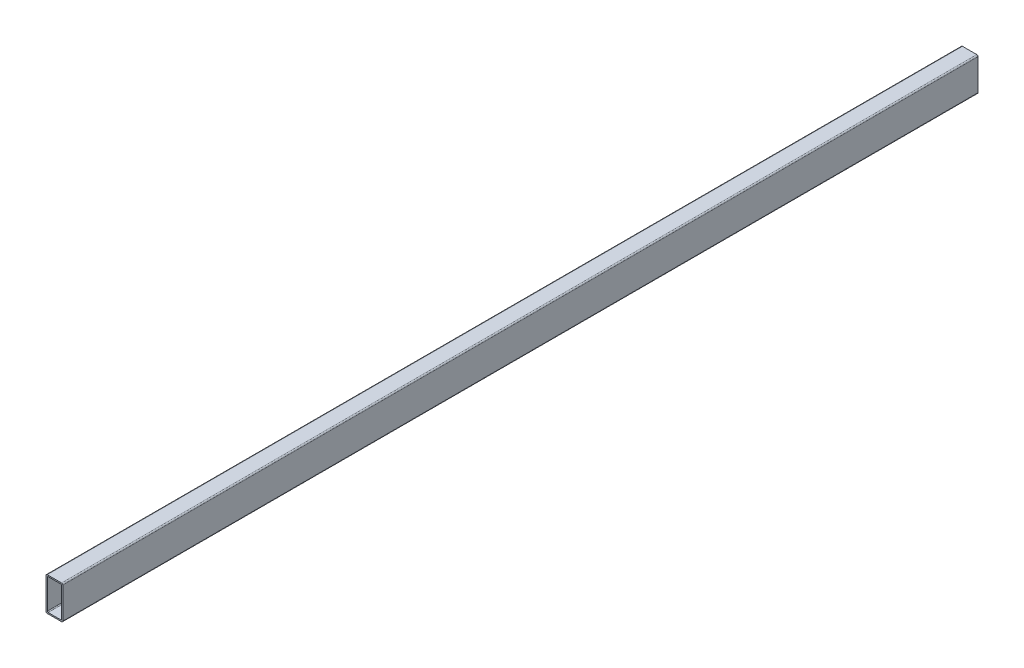
ISO-10303-21;
HEADER;
FILE_DESCRIPTION(('STEP AP214'),'2;1');
FILE_NAME('part.step','',(''),(''),'','','');
FILE_SCHEMA(('AUTOMOTIVE_DESIGN { 1 0 10303 214 1 1 1 1 }'));
ENDSEC;
DATA;
#1=APPLICATION_CONTEXT('core data for automotive mechanical design processes');
#2=APPLICATION_PROTOCOL_DEFINITION('international standard','automotive_design',2000,#1);
#3=PRODUCT_CONTEXT('',#1,'mechanical');
#4=PRODUCT('Part','Part','',(#3));
#5=PRODUCT_RELATED_PRODUCT_CATEGORY('part','',(#4));
#6=PRODUCT_DEFINITION_FORMATION('','',#4);
#7=PRODUCT_DEFINITION_CONTEXT('part definition',#1,'design');
#8=PRODUCT_DEFINITION('design','',#6,#7);
#9=PRODUCT_DEFINITION_SHAPE('','',#8);
#10=(LENGTH_UNIT() NAMED_UNIT(*) SI_UNIT(.MILLI.,.METRE.));
#11=(NAMED_UNIT(*) PLANE_ANGLE_UNIT() SI_UNIT($,.RADIAN.));
#12=(NAMED_UNIT(*) SI_UNIT($,.STERADIAN.) SOLID_ANGLE_UNIT());
#13=UNCERTAINTY_MEASURE_WITH_UNIT(LENGTH_MEASURE(1.E-05),#10,'distance_accuracy_value','');
#14=(GEOMETRIC_REPRESENTATION_CONTEXT(3) GLOBAL_UNCERTAINTY_ASSIGNED_CONTEXT((#13)) GLOBAL_UNIT_ASSIGNED_CONTEXT((#10,
#11,#12)) REPRESENTATION_CONTEXT('',''));
#15=CARTESIAN_POINT('',(0.,0.,0.));
#16=DIRECTION('',(0.,0.,1.));
#17=DIRECTION('',(1.,0.,0.));
#18=AXIS2_PLACEMENT_3D('',#15,#16,#17);
#19=CARTESIAN_POINT('',(-1.5,38.5,-150.));
#20=DIRECTION('',(0.,0.,1.));
#21=DIRECTION('',(1.,0.,0.));
#22=AXIS2_PLACEMENT_3D('',#19,#20,#21);
#23=CYLINDRICAL_SURFACE('',#22,1.5);
#24=DIRECTION('',(0.,0.,1.));
#25=VECTOR('',#24,1.);
#26=CARTESIAN_POINT('',(-1.50000000000002,40.,-150.));
#27=LINE('',#26,#25);
#28=CARTESIAN_POINT('',(-1.50000000000002,40.,-150.));
#29=VERTEX_POINT('',#28);
#30=CARTESIAN_POINT('',(-1.50000000000002,40.,939.980118087264));
#31=VERTEX_POINT('',#30);
#32=EDGE_CURVE('E38',#29,#31,#27,.T.);
#33=ORIENTED_EDGE('',*,*,#32,.T.);
#34=CARTESIAN_POINT('',(-1.5,38.5,939.980118087264));
#35=DIRECTION('',(0.,0.,-1.));
#36=DIRECTION('',(0.,1.,0.));
#37=AXIS2_PLACEMENT_3D('',#34,#35,#36);
#38=CIRCLE('',#37,1.5);
#39=CARTESIAN_POINT('',(0.,38.5,939.980118087264));
#40=VERTEX_POINT('',#39);
#41=EDGE_CURVE('E167',#31,#40,#38,.T.);
#42=ORIENTED_EDGE('',*,*,#41,.T.);
#43=DIRECTION('',(0.,0.,1.));
#44=VECTOR('',#43,1.);
#45=CARTESIAN_POINT('',(0.,38.5,-150.));
#46=LINE('',#45,#44);
#47=CARTESIAN_POINT('',(0.,38.5,-150.));
#48=VERTEX_POINT('',#47);
#49=EDGE_CURVE('E11',#48,#40,#46,.T.);
#50=ORIENTED_EDGE('',*,*,#49,.F.);
#51=CARTESIAN_POINT('',(-1.5,38.5,-150.));
#52=DIRECTION('',(0.,0.,1.));
#53=DIRECTION('',(-1.,0.,0.));
#54=AXIS2_PLACEMENT_3D('',#51,#52,#53);
#55=CIRCLE('',#54,1.5);
#56=EDGE_CURVE('E234',#48,#29,#55,.T.);
#57=ORIENTED_EDGE('',*,*,#56,.T.);
#58=EDGE_LOOP('',(#33,#42,#50,#57));
#59=FACE_BOUND('',#58,.T.);
#60=ADVANCED_FACE('F35',(#59),#23,.T.);
#61=CARTESIAN_POINT('',(0.,38.5,-150.));
#62=DIRECTION('',(1.,0.,0.));
#63=DIRECTION('',(0.,1.,0.));
#64=AXIS2_PLACEMENT_3D('',#61,#62,#63);
#65=PLANE('',#64);
#66=ORIENTED_EDGE('',*,*,#49,.T.);
#67=DIRECTION('',(0.,-1.,0.));
#68=VECTOR('',#67,1.);
#69=CARTESIAN_POINT('',(0.,38.5,939.980118087264));
#70=LINE('',#69,#68);
#71=CARTESIAN_POINT('',(0.,1.50000000000003,939.980118087264));
#72=VERTEX_POINT('',#71);
#73=EDGE_CURVE('E184',#40,#72,#70,.T.);
#74=ORIENTED_EDGE('',*,*,#73,.T.);
#75=DIRECTION('',(0.,0.,1.));
#76=VECTOR('',#75,1.);
#77=CARTESIAN_POINT('',(0.,1.50000000000003,-150.));
#78=LINE('',#77,#76);
#79=CARTESIAN_POINT('',(0.,1.50000000000003,-150.));
#80=VERTEX_POINT('',#79);
#81=EDGE_CURVE('E43',#80,#72,#78,.T.);
#82=ORIENTED_EDGE('',*,*,#81,.F.);
#83=DIRECTION('',(0.,1.,0.));
#84=VECTOR('',#83,1.);
#85=CARTESIAN_POINT('',(0.,38.5,-150.));
#86=LINE('',#85,#84);
#87=EDGE_CURVE('E264',#80,#48,#86,.T.);
#88=ORIENTED_EDGE('',*,*,#87,.T.);
#89=EDGE_LOOP('',(#66,#74,#82,#88));
#90=FACE_BOUND('',#89,.T.);
#91=ADVANCED_FACE('F293',(#90),#65,.T.);
#92=CARTESIAN_POINT('',(-1.5,1.50000000000003,-150.));
#93=DIRECTION('',(0.,0.,1.));
#94=DIRECTION('',(1.,0.,0.));
#95=AXIS2_PLACEMENT_3D('',#92,#93,#94);
#96=CYLINDRICAL_SURFACE('',#95,1.50000000000001);
#97=ORIENTED_EDGE('',*,*,#81,.T.);
#98=CARTESIAN_POINT('',(-1.5,1.50000000000003,939.980118087264));
#99=DIRECTION('',(0.,0.,-1.));
#100=DIRECTION('',(0.,1.,0.));
#101=AXIS2_PLACEMENT_3D('',#98,#99,#100);
#102=CIRCLE('',#101,1.50000000000001);
#103=CARTESIAN_POINT('',(-1.50000000000003,0.,939.980118087264));
#104=VERTEX_POINT('',#103);
#105=EDGE_CURVE('E181',#72,#104,#102,.T.);
#106=ORIENTED_EDGE('',*,*,#105,.T.);
#107=DIRECTION('',(0.,0.,1.));
#108=VECTOR('',#107,1.);
#109=CARTESIAN_POINT('',(-1.50000000000003,0.,-150.));
#110=LINE('',#109,#108);
#111=CARTESIAN_POINT('',(-1.50000000000003,0.,-150.));
#112=VERTEX_POINT('',#111);
#113=EDGE_CURVE('E268',#112,#104,#110,.T.);
#114=ORIENTED_EDGE('',*,*,#113,.F.);
#115=CARTESIAN_POINT('',(-1.5,1.50000000000003,-150.));
#116=DIRECTION('',(0.,0.,1.));
#117=DIRECTION('',(-1.,0.,0.));
#118=AXIS2_PLACEMENT_3D('',#115,#116,#117);
#119=CIRCLE('',#118,1.50000000000001);
#120=EDGE_CURVE('E261',#112,#80,#119,.T.);
#121=ORIENTED_EDGE('',*,*,#120,.T.);
#122=EDGE_LOOP('',(#97,#106,#114,#121));
#123=FACE_BOUND('',#122,.T.);
#124=ADVANCED_FACE('F290',(#123),#96,.T.);
#125=CARTESIAN_POINT('',(-18.5,0.,-150.));
#126=DIRECTION('',(0.,-1.,0.));
#127=DIRECTION('',(0.,0.,-1.));
#128=AXIS2_PLACEMENT_3D('',#125,#126,#127);
#129=PLANE('',#128);
#130=ORIENTED_EDGE('',*,*,#113,.T.);
#131=DIRECTION('',(-1.,0.,0.));
#132=VECTOR('',#131,1.);
#133=CARTESIAN_POINT('',(-18.5,0.,939.980118087264));
#134=LINE('',#133,#132);
#135=CARTESIAN_POINT('',(-18.5,0.,939.980118087264));
#136=VERTEX_POINT('',#135);
#137=EDGE_CURVE('E178',#104,#136,#134,.T.);
#138=ORIENTED_EDGE('',*,*,#137,.T.);
#139=DIRECTION('',(0.,0.,1.));
#140=VECTOR('',#139,1.);
#141=CARTESIAN_POINT('',(-18.5,0.,-150.));
#142=LINE('',#141,#140);
#143=CARTESIAN_POINT('',(-18.5,0.,-150.));
#144=VERTEX_POINT('',#143);
#145=EDGE_CURVE('E270',#144,#136,#142,.T.);
#146=ORIENTED_EDGE('',*,*,#145,.F.);
#147=DIRECTION('',(1.,0.,0.));
#148=VECTOR('',#147,1.);
#149=CARTESIAN_POINT('',(-18.5,0.,-150.));
#150=LINE('',#149,#148);
#151=EDGE_CURVE('E258',#144,#112,#150,.T.);
#152=ORIENTED_EDGE('',*,*,#151,.T.);
#153=EDGE_LOOP('',(#130,#138,#146,#152));
#154=FACE_BOUND('',#153,.T.);
#155=ADVANCED_FACE('F284',(#154),#129,.T.);
#156=CARTESIAN_POINT('',(-18.5,1.50000000000003,-150.));
#157=DIRECTION('',(0.,0.,1.));
#158=DIRECTION('',(1.,0.,0.));
#159=AXIS2_PLACEMENT_3D('',#156,#157,#158);
#160=CYLINDRICAL_SURFACE('',#159,1.50000000000001);
#161=ORIENTED_EDGE('',*,*,#145,.T.);
#162=CARTESIAN_POINT('',(-18.5,1.50000000000003,939.980118087264));
#163=DIRECTION('',(0.,0.,-1.));
#164=DIRECTION('',(0.,1.,0.));
#165=AXIS2_PLACEMENT_3D('',#162,#163,#164);
#166=CIRCLE('',#165,1.50000000000001);
#167=CARTESIAN_POINT('',(-20.,1.50000000000003,939.980118087264));
#168=VERTEX_POINT('',#167);
#169=EDGE_CURVE('E172',#136,#168,#166,.T.);
#170=ORIENTED_EDGE('',*,*,#169,.T.);
#171=DIRECTION('',(0.,0.,1.));
#172=VECTOR('',#171,1.);
#173=CARTESIAN_POINT('',(-20.,1.50000000000003,-150.));
#174=LINE('',#173,#172);
#175=CARTESIAN_POINT('',(-20.,1.50000000000003,-150.));
#176=VERTEX_POINT('',#175);
#177=EDGE_CURVE('E272',#176,#168,#174,.T.);
#178=ORIENTED_EDGE('',*,*,#177,.F.);
#179=CARTESIAN_POINT('',(-18.5,1.50000000000003,-150.));
#180=DIRECTION('',(0.,0.,1.));
#181=DIRECTION('',(1.,0.,0.));
#182=AXIS2_PLACEMENT_3D('',#179,#180,#181);
#183=CIRCLE('',#182,1.50000000000001);
#184=EDGE_CURVE('E255',#176,#144,#183,.T.);
#185=ORIENTED_EDGE('',*,*,#184,.T.);
#186=EDGE_LOOP('',(#161,#170,#178,#185));
#187=FACE_BOUND('',#186,.T.);
#188=ADVANCED_FACE('F281',(#187),#160,.T.);
#189=CARTESIAN_POINT('',(-20.,38.5,-150.));
#190=DIRECTION('',(-1.,0.,0.));
#191=DIRECTION('',(0.,-1.,0.));
#192=AXIS2_PLACEMENT_3D('',#189,#190,#191);
#193=PLANE('',#192);
#194=ORIENTED_EDGE('',*,*,#177,.T.);
#195=DIRECTION('',(0.,1.,0.));
#196=VECTOR('',#195,1.);
#197=CARTESIAN_POINT('',(-20.,38.5,939.980118087264));
#198=LINE('',#197,#196);
#199=CARTESIAN_POINT('',(-20.,38.5,939.980118087264));
#200=VERTEX_POINT('',#199);
#201=EDGE_CURVE('E170',#168,#200,#198,.T.);
#202=ORIENTED_EDGE('',*,*,#201,.T.);
#203=DIRECTION('',(0.,0.,1.));
#204=VECTOR('',#203,1.);
#205=CARTESIAN_POINT('',(-20.,38.5,-150.));
#206=LINE('',#205,#204);
#207=CARTESIAN_POINT('',(-20.,38.5,-150.));
#208=VERTEX_POINT('',#207);
#209=EDGE_CURVE('E158',#208,#200,#206,.T.);
#210=ORIENTED_EDGE('',*,*,#209,.F.);
#211=DIRECTION('',(0.,-1.,0.));
#212=VECTOR('',#211,1.);
#213=CARTESIAN_POINT('',(-20.,38.5,-150.));
#214=LINE('',#213,#212);
#215=EDGE_CURVE('E252',#208,#176,#214,.T.);
#216=ORIENTED_EDGE('',*,*,#215,.T.);
#217=EDGE_LOOP('',(#194,#202,#210,#216));
#218=FACE_BOUND('',#217,.T.);
#219=ADVANCED_FACE('F275',(#218),#193,.T.);
#220=CARTESIAN_POINT('',(-18.5,38.5,-150.));
#221=DIRECTION('',(0.,0.,1.));
#222=DIRECTION('',(1.,0.,0.));
#223=AXIS2_PLACEMENT_3D('',#220,#221,#222);
#224=CYLINDRICAL_SURFACE('',#223,1.50000000000001);
#225=ORIENTED_EDGE('',*,*,#209,.T.);
#226=CARTESIAN_POINT('',(-18.5,38.5,939.980118087264));
#227=DIRECTION('',(0.,0.,-1.));
#228=DIRECTION('',(0.,1.,0.));
#229=AXIS2_PLACEMENT_3D('',#226,#227,#228);
#230=CIRCLE('',#229,1.50000000000001);
#231=CARTESIAN_POINT('',(-18.5,40.,939.980118087264));
#232=VERTEX_POINT('',#231);
#233=EDGE_CURVE('E164',#200,#232,#230,.T.);
#234=ORIENTED_EDGE('',*,*,#233,.T.);
#235=DIRECTION('',(0.,0.,1.));
#236=VECTOR('',#235,1.);
#237=CARTESIAN_POINT('',(-18.5,40.,-150.));
#238=LINE('',#237,#236);
#239=CARTESIAN_POINT('',(-18.5,40.,-150.));
#240=VERTEX_POINT('',#239);
#241=EDGE_CURVE('E148',#240,#232,#238,.T.);
#242=ORIENTED_EDGE('',*,*,#241,.F.);
#243=CARTESIAN_POINT('',(-18.5,38.5,-150.));
#244=DIRECTION('',(0.,0.,1.));
#245=DIRECTION('',(-1.,0.,0.));
#246=AXIS2_PLACEMENT_3D('',#243,#244,#245);
#247=CIRCLE('',#246,1.50000000000001);
#248=EDGE_CURVE('E250',#240,#208,#247,.T.);
#249=ORIENTED_EDGE('',*,*,#248,.T.);
#250=EDGE_LOOP('',(#225,#234,#242,#249));
#251=FACE_BOUND('',#250,.T.);
#252=ADVANCED_FACE('F169',(#251),#224,.T.);
#253=CARTESIAN_POINT('',(-18.5,40.,-150.));
#254=DIRECTION('',(0.,1.,0.));
#255=DIRECTION('',(-1.,0.,0.));
#256=AXIS2_PLACEMENT_3D('',#253,#254,#255);
#257=PLANE('',#256);
#258=ORIENTED_EDGE('',*,*,#241,.T.);
#259=DIRECTION('',(1.,0.,0.));
#260=VECTOR('',#259,1.);
#261=CARTESIAN_POINT('',(-18.5,40.,939.980118087264));
#262=LINE('',#261,#260);
#263=EDGE_CURVE('E151',#232,#31,#262,.T.);
#264=ORIENTED_EDGE('',*,*,#263,.T.);
#265=ORIENTED_EDGE('',*,*,#32,.F.);
#266=DIRECTION('',(-1.,0.,0.));
#267=VECTOR('',#266,1.);
#268=CARTESIAN_POINT('',(-18.5,40.,-150.));
#269=LINE('',#268,#267);
#270=EDGE_CURVE('E153',#29,#240,#269,.T.);
#271=ORIENTED_EDGE('',*,*,#270,.T.);
#272=EDGE_LOOP('',(#258,#264,#265,#271));
#273=FACE_BOUND('',#272,.T.);
#274=ADVANCED_FACE('F150',(#273),#257,.T.);
#275=CARTESIAN_POINT('',(-1.5,38.5,-150.));
#276=DIRECTION('',(0.,0.,-1.));
#277=DIRECTION('',(-1.,0.,0.));
#278=AXIS2_PLACEMENT_3D('',#275,#276,#277);
#279=PLANE('',#278);
#280=CARTESIAN_POINT('',(-2.5,2.50000000000003,-150.));
#281=DIRECTION('',(0.,0.,1.));
#282=DIRECTION('',(-1.,0.,0.));
#283=AXIS2_PLACEMENT_3D('',#280,#281,#282);
#284=CIRCLE('',#283,0.999999999999994);
#285=CARTESIAN_POINT('',(-2.5,1.50000000000004,-150.));
#286=VERTEX_POINT('',#285);
#287=CARTESIAN_POINT('',(-1.5,2.50000000000003,-150.));
#288=VERTEX_POINT('',#287);
#289=EDGE_CURVE('E194',#286,#288,#284,.T.);
#290=ORIENTED_EDGE('',*,*,#289,.T.);
#291=DIRECTION('',(0.,1.,0.));
#292=VECTOR('',#291,1.);
#293=CARTESIAN_POINT('',(-1.5,37.5,-150.));
#294=LINE('',#293,#292);
#295=CARTESIAN_POINT('',(-1.5,37.5,-150.));
#296=VERTEX_POINT('',#295);
#297=EDGE_CURVE('E212',#288,#296,#294,.T.);
#298=ORIENTED_EDGE('',*,*,#297,.T.);
#299=CARTESIAN_POINT('',(-2.5,37.5,-150.));
#300=DIRECTION('',(0.,0.,1.));
#301=DIRECTION('',(-1.,0.,0.));
#302=AXIS2_PLACEMENT_3D('',#299,#300,#301);
#303=CIRCLE('',#302,1.);
#304=CARTESIAN_POINT('',(-2.5,38.5,-150.));
#305=VERTEX_POINT('',#304);
#306=EDGE_CURVE('E51',#296,#305,#303,.T.);
#307=ORIENTED_EDGE('',*,*,#306,.T.);
#308=DIRECTION('',(-1.,0.,0.));
#309=VECTOR('',#308,1.);
#310=CARTESIAN_POINT('',(-17.5,38.5,-150.));
#311=LINE('',#310,#309);
#312=CARTESIAN_POINT('',(-17.5,38.5,-150.));
#313=VERTEX_POINT('',#312);
#314=EDGE_CURVE('E216',#305,#313,#311,.T.);
#315=ORIENTED_EDGE('',*,*,#314,.T.);
#316=CARTESIAN_POINT('',(-17.5,37.5,-150.));
#317=DIRECTION('',(0.,0.,1.));
#318=DIRECTION('',(-1.,0.,0.));
#319=AXIS2_PLACEMENT_3D('',#316,#317,#318);
#320=CIRCLE('',#319,1.);
#321=CARTESIAN_POINT('',(-18.5,37.5,-150.));
#322=VERTEX_POINT('',#321);
#323=EDGE_CURVE('E219',#313,#322,#320,.T.);
#324=ORIENTED_EDGE('',*,*,#323,.T.);
#325=DIRECTION('',(0.,-1.,0.));
#326=VECTOR('',#325,1.);
#327=CARTESIAN_POINT('',(-18.5,37.5,-150.));
#328=LINE('',#327,#326);
#329=CARTESIAN_POINT('',(-18.5,2.50000000000003,-150.));
#330=VERTEX_POINT('',#329);
#331=EDGE_CURVE('E222',#322,#330,#328,.T.);
#332=ORIENTED_EDGE('',*,*,#331,.T.);
#333=CARTESIAN_POINT('',(-17.5,2.50000000000003,-150.));
#334=DIRECTION('',(0.,0.,1.));
#335=DIRECTION('',(1.,0.,0.));
#336=AXIS2_PLACEMENT_3D('',#333,#334,#335);
#337=CIRCLE('',#336,0.999999999999999);
#338=CARTESIAN_POINT('',(-17.5,1.50000000000003,-150.));
#339=VERTEX_POINT('',#338);
#340=EDGE_CURVE('E225',#330,#339,#337,.T.);
#341=ORIENTED_EDGE('',*,*,#340,.T.);
#342=DIRECTION('',(1.,0.,0.));
#343=VECTOR('',#342,1.);
#344=CARTESIAN_POINT('',(-17.5,1.50000000000003,-150.));
#345=LINE('',#344,#343);
#346=EDGE_CURVE('E228',#339,#286,#345,.T.);
#347=ORIENTED_EDGE('',*,*,#346,.T.);
#348=EDGE_LOOP('',(#290,#298,#307,#315,#324,#332,#341,#347));
#349=FACE_BOUND('',#348,.T.);
#350=ORIENTED_EDGE('',*,*,#56,.F.);
#351=ORIENTED_EDGE('',*,*,#87,.F.);
#352=ORIENTED_EDGE('',*,*,#120,.F.);
#353=ORIENTED_EDGE('',*,*,#151,.F.);
#354=ORIENTED_EDGE('',*,*,#184,.F.);
#355=ORIENTED_EDGE('',*,*,#215,.F.);
#356=ORIENTED_EDGE('',*,*,#248,.F.);
#357=ORIENTED_EDGE('',*,*,#270,.F.);
#358=EDGE_LOOP('',(#350,#351,#352,#353,#354,#355,#356,#357));
#359=FACE_BOUND('',#358,.T.);
#360=ADVANCED_FACE('F287',(#349,#359),#279,.T.);
#361=CARTESIAN_POINT('',(-2.5,2.50000000000003,-150.));
#362=DIRECTION('',(0.,0.,1.));
#363=DIRECTION('',(1.,0.,0.));
#364=AXIS2_PLACEMENT_3D('',#361,#362,#363);
#365=CYLINDRICAL_SURFACE('',#364,0.999999999999994);
#366=DIRECTION('',(0.,0.,1.));
#367=VECTOR('',#366,1.);
#368=CARTESIAN_POINT('',(-2.5,1.50000000000004,-150.));
#369=LINE('',#368,#367);
#370=CARTESIAN_POINT('',(-2.5,1.50000000000004,939.980118087264));
#371=VERTEX_POINT('',#370);
#372=EDGE_CURVE('E232',#286,#371,#369,.T.);
#373=ORIENTED_EDGE('',*,*,#372,.T.);
#374=CARTESIAN_POINT('',(-2.5,2.50000000000003,939.980118087264));
#375=DIRECTION('',(0.,0.,-1.));
#376=DIRECTION('',(0.,1.,0.));
#377=AXIS2_PLACEMENT_3D('',#374,#375,#376);
#378=CIRCLE('',#377,0.999999999999994);
#379=CARTESIAN_POINT('',(-1.5,2.50000000000003,939.980118087264));
#380=VERTEX_POINT('',#379);
#381=EDGE_CURVE('E187',#380,#371,#378,.T.);
#382=ORIENTED_EDGE('',*,*,#381,.F.);
#383=DIRECTION('',(0.,0.,1.));
#384=VECTOR('',#383,1.);
#385=CARTESIAN_POINT('',(-1.5,2.50000000000003,-150.));
#386=LINE('',#385,#384);
#387=EDGE_CURVE('E231',#288,#380,#386,.T.);
#388=ORIENTED_EDGE('',*,*,#387,.F.);
#389=ORIENTED_EDGE('',*,*,#289,.F.);
#390=EDGE_LOOP('',(#373,#382,#388,#389));
#391=FACE_BOUND('',#390,.T.);
#392=ADVANCED_FACE('F315',(#391),#365,.F.);
#393=CARTESIAN_POINT('',(-17.5,1.50000000000003,-150.));
#394=DIRECTION('',(0.,-1.,0.));
#395=DIRECTION('',(1.,0.,0.));
#396=AXIS2_PLACEMENT_3D('',#393,#394,#395);
#397=PLANE('',#396);
#398=DIRECTION('',(0.,0.,1.));
#399=VECTOR('',#398,1.);
#400=CARTESIAN_POINT('',(-17.5,1.50000000000003,-150.));
#401=LINE('',#400,#399);
#402=CARTESIAN_POINT('',(-17.5,1.50000000000003,939.980118087264));
#403=VERTEX_POINT('',#402);
#404=EDGE_CURVE('E235',#339,#403,#401,.T.);
#405=ORIENTED_EDGE('',*,*,#404,.T.);
#406=DIRECTION('',(-1.,0.,0.));
#407=VECTOR('',#406,1.);
#408=CARTESIAN_POINT('',(-17.5,1.50000000000003,939.980118087264));
#409=LINE('',#408,#407);
#410=EDGE_CURVE('E190',#371,#403,#409,.T.);
#411=ORIENTED_EDGE('',*,*,#410,.F.);
#412=ORIENTED_EDGE('',*,*,#372,.F.);
#413=ORIENTED_EDGE('',*,*,#346,.F.);
#414=EDGE_LOOP('',(#405,#411,#412,#413));
#415=FACE_BOUND('',#414,.T.);
#416=ADVANCED_FACE('F320',(#415),#397,.F.);
#417=CARTESIAN_POINT('',(-17.5,2.50000000000003,-150.));
#418=DIRECTION('',(0.,0.,1.));
#419=DIRECTION('',(1.,0.,0.));
#420=AXIS2_PLACEMENT_3D('',#417,#418,#419);
#421=CYLINDRICAL_SURFACE('',#420,0.999999999999999);
#422=DIRECTION('',(0.,0.,1.));
#423=VECTOR('',#422,1.);
#424=CARTESIAN_POINT('',(-18.5,2.50000000000003,-150.));
#425=LINE('',#424,#423);
#426=CARTESIAN_POINT('',(-18.5,2.50000000000003,939.980118087264));
#427=VERTEX_POINT('',#426);
#428=EDGE_CURVE('E237',#330,#427,#425,.T.);
#429=ORIENTED_EDGE('',*,*,#428,.T.);
#430=CARTESIAN_POINT('',(-17.5,2.50000000000003,939.980118087264));
#431=DIRECTION('',(0.,0.,-1.));
#432=DIRECTION('',(0.,1.,0.));
#433=AXIS2_PLACEMENT_3D('',#430,#431,#432);
#434=CIRCLE('',#433,0.999999999999999);
#435=EDGE_CURVE('E207',#403,#427,#434,.T.);
#436=ORIENTED_EDGE('',*,*,#435,.F.);
#437=ORIENTED_EDGE('',*,*,#404,.F.);
#438=ORIENTED_EDGE('',*,*,#340,.F.);
#439=EDGE_LOOP('',(#429,#436,#437,#438));
#440=FACE_BOUND('',#439,.T.);
#441=ADVANCED_FACE('F347',(#440),#421,.F.);
#442=CARTESIAN_POINT('',(-18.5,37.5,-150.));
#443=DIRECTION('',(-1.,0.,0.));
#444=DIRECTION('',(0.,-1.,0.));
#445=AXIS2_PLACEMENT_3D('',#442,#443,#444);
#446=PLANE('',#445);
#447=DIRECTION('',(0.,0.,1.));
#448=VECTOR('',#447,1.);
#449=CARTESIAN_POINT('',(-18.5,37.5,-150.));
#450=LINE('',#449,#448);
#451=CARTESIAN_POINT('',(-18.5,37.5,939.980118087264));
#452=VERTEX_POINT('',#451);
#453=EDGE_CURVE('E239',#322,#452,#450,.T.);
#454=ORIENTED_EDGE('',*,*,#453,.T.);
#455=DIRECTION('',(0.,1.,0.));
#456=VECTOR('',#455,1.);
#457=CARTESIAN_POINT('',(-18.5,37.5,939.980118087264));
#458=LINE('',#457,#456);
#459=EDGE_CURVE('E204',#427,#452,#458,.T.);
#460=ORIENTED_EDGE('',*,*,#459,.F.);
#461=ORIENTED_EDGE('',*,*,#428,.F.);
#462=ORIENTED_EDGE('',*,*,#331,.F.);
#463=EDGE_LOOP('',(#454,#460,#461,#462));
#464=FACE_BOUND('',#463,.T.);
#465=ADVANCED_FACE('F343',(#464),#446,.F.);
#466=CARTESIAN_POINT('',(-17.5,37.5,-150.));
#467=DIRECTION('',(0.,0.,1.));
#468=DIRECTION('',(1.,0.,0.));
#469=AXIS2_PLACEMENT_3D('',#466,#467,#468);
#470=CYLINDRICAL_SURFACE('',#469,1.);
#471=DIRECTION('',(0.,0.,1.));
#472=VECTOR('',#471,1.);
#473=CARTESIAN_POINT('',(-17.5,38.5,-150.));
#474=LINE('',#473,#472);
#475=CARTESIAN_POINT('',(-17.5,38.5,939.980118087264));
#476=VERTEX_POINT('',#475);
#477=EDGE_CURVE('E241',#313,#476,#474,.T.);
#478=ORIENTED_EDGE('',*,*,#477,.T.);
#479=CARTESIAN_POINT('',(-17.5,37.5,939.980118087264));
#480=DIRECTION('',(0.,0.,-1.));
#481=DIRECTION('',(0.,1.,0.));
#482=AXIS2_PLACEMENT_3D('',#479,#480,#481);
#483=CIRCLE('',#482,1.);
#484=EDGE_CURVE('E201',#452,#476,#483,.T.);
#485=ORIENTED_EDGE('',*,*,#484,.F.);
#486=ORIENTED_EDGE('',*,*,#453,.F.);
#487=ORIENTED_EDGE('',*,*,#323,.F.);
#488=EDGE_LOOP('',(#478,#485,#486,#487));
#489=FACE_BOUND('',#488,.T.);
#490=ADVANCED_FACE('F340',(#489),#470,.F.);
#491=CARTESIAN_POINT('',(-17.5,38.5,-150.));
#492=DIRECTION('',(0.,1.,0.));
#493=DIRECTION('',(0.,0.,1.));
#494=AXIS2_PLACEMENT_3D('',#491,#492,#493);
#495=PLANE('',#494);
#496=DIRECTION('',(0.,0.,1.));
#497=VECTOR('',#496,1.);
#498=CARTESIAN_POINT('',(-2.5,38.5,-150.));
#499=LINE('',#498,#497);
#500=CARTESIAN_POINT('',(-2.5,38.5,939.980118087264));
#501=VERTEX_POINT('',#500);
#502=EDGE_CURVE('E243',#305,#501,#499,.T.);
#503=ORIENTED_EDGE('',*,*,#502,.T.);
#504=DIRECTION('',(1.,0.,0.));
#505=VECTOR('',#504,1.);
#506=CARTESIAN_POINT('',(-17.5,38.5,939.980118087264));
#507=LINE('',#506,#505);
#508=EDGE_CURVE('E198',#476,#501,#507,.T.);
#509=ORIENTED_EDGE('',*,*,#508,.F.);
#510=ORIENTED_EDGE('',*,*,#477,.F.);
#511=ORIENTED_EDGE('',*,*,#314,.F.);
#512=EDGE_LOOP('',(#503,#509,#510,#511));
#513=FACE_BOUND('',#512,.T.);
#514=ADVANCED_FACE('F335',(#513),#495,.F.);
#515=CARTESIAN_POINT('',(-2.5,37.5,-150.));
#516=DIRECTION('',(0.,0.,1.));
#517=DIRECTION('',(1.,0.,0.));
#518=AXIS2_PLACEMENT_3D('',#515,#516,#517);
#519=CYLINDRICAL_SURFACE('',#518,1.);
#520=DIRECTION('',(0.,0.,1.));
#521=VECTOR('',#520,1.);
#522=CARTESIAN_POINT('',(-1.5,37.5,-150.));
#523=LINE('',#522,#521);
#524=CARTESIAN_POINT('',(-1.5,37.5,939.980118087264));
#525=VERTEX_POINT('',#524);
#526=EDGE_CURVE('E245',#296,#525,#523,.T.);
#527=ORIENTED_EDGE('',*,*,#526,.T.);
#528=CARTESIAN_POINT('',(-2.5,37.5,939.980118087264));
#529=DIRECTION('',(0.,0.,-1.));
#530=DIRECTION('',(0.,1.,0.));
#531=AXIS2_PLACEMENT_3D('',#528,#529,#530);
#532=CIRCLE('',#531,1.);
#533=EDGE_CURVE('E195',#501,#525,#532,.T.);
#534=ORIENTED_EDGE('',*,*,#533,.F.);
#535=ORIENTED_EDGE('',*,*,#502,.F.);
#536=ORIENTED_EDGE('',*,*,#306,.F.);
#537=EDGE_LOOP('',(#527,#534,#535,#536));
#538=FACE_BOUND('',#537,.T.);
#539=ADVANCED_FACE('F330',(#538),#519,.F.);
#540=CARTESIAN_POINT('',(-1.5,37.5,-150.));
#541=DIRECTION('',(1.,0.,0.));
#542=DIRECTION('',(0.,1.,0.));
#543=AXIS2_PLACEMENT_3D('',#540,#541,#542);
#544=PLANE('',#543);
#545=ORIENTED_EDGE('',*,*,#387,.T.);
#546=DIRECTION('',(0.,-1.,0.));
#547=VECTOR('',#546,1.);
#548=CARTESIAN_POINT('',(-1.5,37.5,939.980118087264));
#549=LINE('',#548,#547);
#550=EDGE_CURVE('E191',#525,#380,#549,.T.);
#551=ORIENTED_EDGE('',*,*,#550,.F.);
#552=ORIENTED_EDGE('',*,*,#526,.F.);
#553=ORIENTED_EDGE('',*,*,#297,.F.);
#554=EDGE_LOOP('',(#545,#551,#552,#553));
#555=FACE_BOUND('',#554,.T.);
#556=ADVANCED_FACE('F328',(#555),#544,.F.);
#557=CARTESIAN_POINT('',(-114.33630944789,95.8117780527355,939.980118087264));
#558=DIRECTION('',(0.,0.,-1.));
#559=DIRECTION('',(0.,-1.,0.));
#560=AXIS2_PLACEMENT_3D('',#557,#558,#559);
#561=PLANE('',#560);
#562=ORIENTED_EDGE('',*,*,#381,.T.);
#563=ORIENTED_EDGE('',*,*,#410,.T.);
#564=ORIENTED_EDGE('',*,*,#435,.T.);
#565=ORIENTED_EDGE('',*,*,#459,.T.);
#566=ORIENTED_EDGE('',*,*,#484,.T.);
#567=ORIENTED_EDGE('',*,*,#508,.T.);
#568=ORIENTED_EDGE('',*,*,#533,.T.);
#569=ORIENTED_EDGE('',*,*,#550,.T.);
#570=EDGE_LOOP('',(#562,#563,#564,#565,#566,#567,#568,#569));
#571=FACE_BOUND('',#570,.T.);
#572=ORIENTED_EDGE('',*,*,#263,.F.);
#573=ORIENTED_EDGE('',*,*,#233,.F.);
#574=ORIENTED_EDGE('',*,*,#201,.F.);
#575=ORIENTED_EDGE('',*,*,#169,.F.);
#576=ORIENTED_EDGE('',*,*,#137,.F.);
#577=ORIENTED_EDGE('',*,*,#105,.F.);
#578=ORIENTED_EDGE('',*,*,#73,.F.);
#579=ORIENTED_EDGE('',*,*,#41,.F.);
#580=EDGE_LOOP('',(#572,#573,#574,#575,#576,#577,#578,#579));
#581=FACE_BOUND('',#580,.T.);
#582=ADVANCED_FACE('F162',(#571,#581),#561,.F.);
#583=CLOSED_SHELL('',(#60,#91,#124,#155,#188,#219,#252,#274,#360,#392,#416,#441,#465,#490,#514,
#539,#556,#582));
#584=MANIFOLD_SOLID_BREP('B2',#583);
#585=ADVANCED_BREP_SHAPE_REPRESENTATION('',(#18,#584),#14);
#586=SHAPE_DEFINITION_REPRESENTATION(#9,#585);
ENDSEC;
END-ISO-10303-21;
